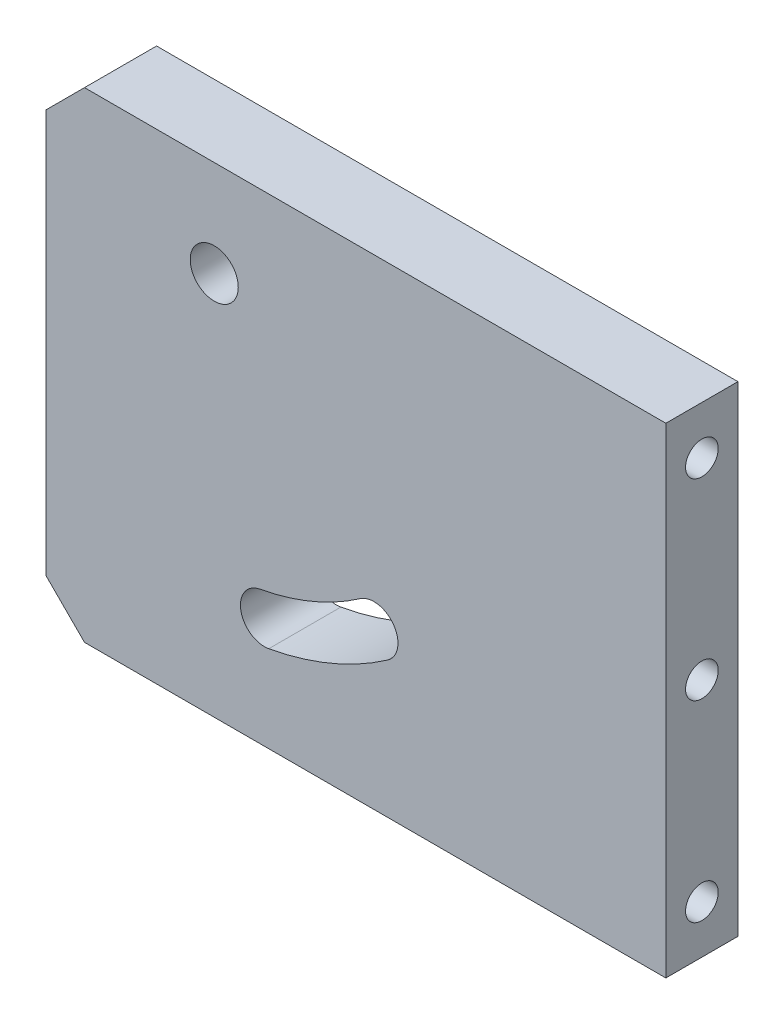
ISO-10303-21;
HEADER;
FILE_DESCRIPTION(('STEP AP214'),'2;1');
FILE_NAME('part.step','',(''),(''),'','','');
FILE_SCHEMA(('AUTOMOTIVE_DESIGN { 1 0 10303 214 1 1 1 1 }'));
ENDSEC;
DATA;
#1=APPLICATION_CONTEXT('core data for automotive mechanical design processes');
#2=APPLICATION_PROTOCOL_DEFINITION('international standard','automotive_design',2000,#1);
#3=PRODUCT_CONTEXT('',#1,'mechanical');
#4=PRODUCT('Part','Part','',(#3));
#5=PRODUCT_RELATED_PRODUCT_CATEGORY('part','',(#4));
#6=PRODUCT_DEFINITION_FORMATION('','',#4);
#7=PRODUCT_DEFINITION_CONTEXT('part definition',#1,'design');
#8=PRODUCT_DEFINITION('design','',#6,#7);
#9=PRODUCT_DEFINITION_SHAPE('','',#8);
#10=(LENGTH_UNIT() NAMED_UNIT(*) SI_UNIT(.MILLI.,.METRE.));
#11=(NAMED_UNIT(*) PLANE_ANGLE_UNIT() SI_UNIT($,.RADIAN.));
#12=(NAMED_UNIT(*) SI_UNIT($,.STERADIAN.) SOLID_ANGLE_UNIT());
#13=UNCERTAINTY_MEASURE_WITH_UNIT(LENGTH_MEASURE(1.E-05),#10,'distance_accuracy_value','');
#14=(GEOMETRIC_REPRESENTATION_CONTEXT(3) GLOBAL_UNCERTAINTY_ASSIGNED_CONTEXT((#13)) GLOBAL_UNIT_ASSIGNED_CONTEXT((#10,
#11,#12)) REPRESENTATION_CONTEXT('',''));
#15=CARTESIAN_POINT('',(0.,0.,0.));
#16=DIRECTION('',(0.,0.,1.));
#17=DIRECTION('',(1.,0.,0.));
#18=AXIS2_PLACEMENT_3D('',#15,#16,#17);
#19=CARTESIAN_POINT('',(64.5,-50.,15.));
#20=DIRECTION('',(-1.,0.,0.));
#21=DIRECTION('',(0.,0.,1.));
#22=AXIS2_PLACEMENT_3D('',#19,#20,#21);
#23=PLANE('',#22);
#24=CARTESIAN_POINT('',(64.5,40.,7.5));
#25=DIRECTION('',(1.,0.,0.));
#26=DIRECTION('',(0.,0.,-1.));
#27=AXIS2_PLACEMENT_3D('',#24,#25,#26);
#28=CIRCLE('',#27,3.4);
#29=CARTESIAN_POINT('',(64.5,40.,4.1));
#30=VERTEX_POINT('',#29);
#31=EDGE_CURVE('E132',#30,#30,#28,.T.);
#32=ORIENTED_EDGE('',*,*,#31,.F.);
#33=EDGE_LOOP('',(#32));
#34=FACE_BOUND('',#33,.T.);
#35=CARTESIAN_POINT('',(64.5,0.,7.5));
#36=DIRECTION('',(1.,0.,0.));
#37=DIRECTION('',(0.,0.,-1.));
#38=AXIS2_PLACEMENT_3D('',#35,#36,#37);
#39=CIRCLE('',#38,3.4);
#40=CARTESIAN_POINT('',(64.5,0.,4.1));
#41=VERTEX_POINT('',#40);
#42=EDGE_CURVE('E131',#41,#41,#39,.T.);
#43=ORIENTED_EDGE('',*,*,#42,.F.);
#44=EDGE_LOOP('',(#43));
#45=FACE_BOUND('',#44,.T.);
#46=DIRECTION('',(0.,1.,0.));
#47=VECTOR('',#46,1.);
#48=CARTESIAN_POINT('',(64.5,-50.,0.));
#49=LINE('',#48,#47);
#50=CARTESIAN_POINT('',(64.5,-50.,0.));
#51=VERTEX_POINT('',#50);
#52=CARTESIAN_POINT('',(64.5,50.,0.));
#53=VERTEX_POINT('',#52);
#54=EDGE_CURVE('E177',#51,#53,#49,.T.);
#55=ORIENTED_EDGE('',*,*,#54,.T.);
#56=DIRECTION('',(0.,0.,-1.));
#57=VECTOR('',#56,1.);
#58=CARTESIAN_POINT('',(64.5,50.,15.));
#59=LINE('',#58,#57);
#60=CARTESIAN_POINT('',(64.5,50.,15.));
#61=VERTEX_POINT('',#60);
#62=EDGE_CURVE('E11',#61,#53,#59,.T.);
#63=ORIENTED_EDGE('',*,*,#62,.F.);
#64=DIRECTION('',(0.,1.,0.));
#65=VECTOR('',#64,1.);
#66=CARTESIAN_POINT('',(64.5,-50.,15.));
#67=LINE('',#66,#65);
#68=CARTESIAN_POINT('',(64.5,-50.,15.));
#69=VERTEX_POINT('',#68);
#70=EDGE_CURVE('E180',#69,#61,#67,.T.);
#71=ORIENTED_EDGE('',*,*,#70,.F.);
#72=DIRECTION('',(0.,0.,-1.));
#73=VECTOR('',#72,1.);
#74=CARTESIAN_POINT('',(64.5,-50.,15.));
#75=LINE('',#74,#73);
#76=EDGE_CURVE('E194',#69,#51,#75,.T.);
#77=ORIENTED_EDGE('',*,*,#76,.T.);
#78=EDGE_LOOP('',(#55,#63,#71,#77));
#79=FACE_BOUND('',#78,.T.);
#80=CARTESIAN_POINT('',(64.5,-40.,7.5));
#81=DIRECTION('',(1.,0.,0.));
#82=DIRECTION('',(0.,0.,-1.));
#83=AXIS2_PLACEMENT_3D('',#80,#81,#82);
#84=CIRCLE('',#83,3.4);
#85=CARTESIAN_POINT('',(64.5,-40.,4.1));
#86=VERTEX_POINT('',#85);
#87=EDGE_CURVE('E142',#86,#86,#84,.T.);
#88=ORIENTED_EDGE('',*,*,#87,.F.);
#89=EDGE_LOOP('',(#88));
#90=FACE_BOUND('',#89,.T.);
#91=ADVANCED_FACE('F36',(#34,#45,#79,#90),#23,.F.);
#92=CARTESIAN_POINT('',(64.5,50.,15.));
#93=DIRECTION('',(0.,0.,1.));
#94=DIRECTION('',(1.,0.,0.));
#95=AXIS2_PLACEMENT_3D('',#92,#93,#94);
#96=PLANE('',#95);
#97=CARTESIAN_POINT('',(-29.5,30.,15.));
#98=DIRECTION('',(0.,0.,1.));
#99=DIRECTION('',(1.,0.,0.));
#100=AXIS2_PLACEMENT_3D('',#97,#98,#99);
#101=CIRCLE('',#100,5.);
#102=CARTESIAN_POINT('',(-24.5,30.,15.));
#103=VERTEX_POINT('',#102);
#104=EDGE_CURVE('E174',#103,#103,#101,.T.);
#105=ORIENTED_EDGE('',*,*,#104,.F.);
#106=EDGE_LOOP('',(#105));
#107=FACE_BOUND('',#106,.T.);
#108=ORIENTED_EDGE('',*,*,#70,.T.);
#109=DIRECTION('',(-1.,0.,0.));
#110=VECTOR('',#109,1.);
#111=CARTESIAN_POINT('',(64.5,50.,15.));
#112=LINE('',#111,#110);
#113=CARTESIAN_POINT('',(-56.5,50.,15.));
#114=VERTEX_POINT('',#113);
#115=EDGE_CURVE('E183',#61,#114,#112,.T.);
#116=ORIENTED_EDGE('',*,*,#115,.T.);
#117=DIRECTION('',(-0.707106781186548,-0.707106781186548,0.));
#118=VECTOR('',#117,1.);
#119=CARTESIAN_POINT('',(-64.5,42.,15.));
#120=LINE('',#119,#118);
#121=CARTESIAN_POINT('',(-64.5,42.,15.));
#122=VERTEX_POINT('',#121);
#123=EDGE_CURVE('E186',#114,#122,#120,.T.);
#124=ORIENTED_EDGE('',*,*,#123,.T.);
#125=DIRECTION('',(0.,-1.,0.));
#126=VECTOR('',#125,1.);
#127=CARTESIAN_POINT('',(-64.5,-42.,15.));
#128=LINE('',#127,#126);
#129=CARTESIAN_POINT('',(-64.5,-42.,15.));
#130=VERTEX_POINT('',#129);
#131=EDGE_CURVE('E188',#122,#130,#128,.T.);
#132=ORIENTED_EDGE('',*,*,#131,.T.);
#133=DIRECTION('',(0.707106781186548,-0.707106781186547,0.));
#134=VECTOR('',#133,1.);
#135=CARTESIAN_POINT('',(-64.5,-42.,15.));
#136=LINE('',#135,#134);
#137=CARTESIAN_POINT('',(-56.5,-50.,15.));
#138=VERTEX_POINT('',#137);
#139=EDGE_CURVE('E190',#130,#138,#136,.T.);
#140=ORIENTED_EDGE('',*,*,#139,.T.);
#141=DIRECTION('',(1.,0.,0.));
#142=VECTOR('',#141,1.);
#143=CARTESIAN_POINT('',(64.5,-50.,15.));
#144=LINE('',#143,#142);
#145=EDGE_CURVE('E192',#138,#69,#144,.T.);
#146=ORIENTED_EDGE('',*,*,#145,.T.);
#147=EDGE_LOOP('',(#108,#116,#124,#132,#140,#146));
#148=FACE_BOUND('',#147,.T.);
#149=CARTESIAN_POINT('',(-29.5,30.,15.));
#150=DIRECTION('',(0.,0.,1.));
#151=DIRECTION('',(1.,0.,0.));
#152=AXIS2_PLACEMENT_3D('',#149,#150,#151);
#153=CIRCLE('',#152,63.);
#154=CARTESIAN_POINT('',(-18.1489244079897,-31.9689687093828,15.));
#155=VERTEX_POINT('',#154);
#156=CARTESIAN_POINT('',(6.60828939653203,-21.6254921221705,15.));
#157=VERTEX_POINT('',#156);
#158=EDGE_CURVE('E150',#155,#157,#153,.T.);
#159=ORIENTED_EDGE('',*,*,#158,.F.);
#160=CARTESIAN_POINT('',(-19.0498034232286,-27.0507965895905,15.));
#161=DIRECTION('',(0.,0.,1.));
#162=DIRECTION('',(1.,0.,0.));
#163=AXIS2_PLACEMENT_3D('',#160,#161,#162);
#164=CIRCLE('',#163,5.00000000000001);
#165=CARTESIAN_POINT('',(-19.9506824384675,-22.1326244697982,15.));
#166=VERTEX_POINT('',#165);
#167=EDGE_CURVE('E148',#166,#155,#164,.T.);
#168=ORIENTED_EDGE('',*,*,#167,.F.);
#169=CARTESIAN_POINT('',(-29.5,30.,15.));
#170=DIRECTION('',(0.,0.,-1.));
#171=DIRECTION('',(1.,0.,0.));
#172=AXIS2_PLACEMENT_3D('',#169,#170,#171);
#173=CIRCLE('',#172,53.);
#174=CARTESIAN_POINT('',(0.876814889146,-13.4309695630958,15.));
#175=VERTEX_POINT('',#174);
#176=EDGE_CURVE('E155',#175,#166,#173,.T.);
#177=ORIENTED_EDGE('',*,*,#176,.F.);
#178=CARTESIAN_POINT('',(3.74255214283901,-17.5282308426332,15.));
#179=DIRECTION('',(0.,0.,1.));
#180=DIRECTION('',(1.,0.,0.));
#181=AXIS2_PLACEMENT_3D('',#178,#179,#180);
#182=CIRCLE('',#181,5.);
#183=EDGE_CURVE('E153',#157,#175,#182,.T.);
#184=ORIENTED_EDGE('',*,*,#183,.F.);
#185=EDGE_LOOP('',(#159,#168,#177,#184));
#186=FACE_BOUND('',#185,.T.);
#187=ADVANCED_FACE('F241',(#107,#148,#186),#96,.T.);
#188=CARTESIAN_POINT('',(64.5,50.,0.));
#189=DIRECTION('',(0.,0.,1.));
#190=DIRECTION('',(1.,0.,0.));
#191=AXIS2_PLACEMENT_3D('',#188,#189,#190);
#192=PLANE('',#191);
#193=CARTESIAN_POINT('',(-29.5,30.,0.));
#194=DIRECTION('',(0.,0.,1.));
#195=DIRECTION('',(1.,0.,0.));
#196=AXIS2_PLACEMENT_3D('',#193,#194,#195);
#197=CIRCLE('',#196,5.);
#198=CARTESIAN_POINT('',(-24.5,30.,0.));
#199=VERTEX_POINT('',#198);
#200=EDGE_CURVE('E173',#199,#199,#197,.T.);
#201=ORIENTED_EDGE('',*,*,#200,.T.);
#202=EDGE_LOOP('',(#201));
#203=FACE_BOUND('',#202,.T.);
#204=ORIENTED_EDGE('',*,*,#54,.F.);
#205=DIRECTION('',(1.,0.,0.));
#206=VECTOR('',#205,1.);
#207=CARTESIAN_POINT('',(64.5,-50.,0.));
#208=LINE('',#207,#206);
#209=CARTESIAN_POINT('',(-56.5,-50.,0.));
#210=VERTEX_POINT('',#209);
#211=EDGE_CURVE('E184',#210,#51,#208,.T.);
#212=ORIENTED_EDGE('',*,*,#211,.F.);
#213=DIRECTION('',(0.707106781186548,-0.707106781186547,0.));
#214=VECTOR('',#213,1.);
#215=CARTESIAN_POINT('',(-64.5,-42.,0.));
#216=LINE('',#215,#214);
#217=CARTESIAN_POINT('',(-64.5,-42.,0.));
#218=VERTEX_POINT('',#217);
#219=EDGE_CURVE('E203',#218,#210,#216,.T.);
#220=ORIENTED_EDGE('',*,*,#219,.F.);
#221=DIRECTION('',(0.,-1.,0.));
#222=VECTOR('',#221,1.);
#223=CARTESIAN_POINT('',(-64.5,-42.,0.));
#224=LINE('',#223,#222);
#225=CARTESIAN_POINT('',(-64.5,42.,0.));
#226=VERTEX_POINT('',#225);
#227=EDGE_CURVE('E201',#226,#218,#224,.T.);
#228=ORIENTED_EDGE('',*,*,#227,.F.);
#229=DIRECTION('',(-0.707106781186548,-0.707106781186548,0.));
#230=VECTOR('',#229,1.);
#231=CARTESIAN_POINT('',(-64.5,42.,0.));
#232=LINE('',#231,#230);
#233=CARTESIAN_POINT('',(-56.5,50.,0.));
#234=VERTEX_POINT('',#233);
#235=EDGE_CURVE('E199',#234,#226,#232,.T.);
#236=ORIENTED_EDGE('',*,*,#235,.F.);
#237=DIRECTION('',(-1.,0.,0.));
#238=VECTOR('',#237,1.);
#239=CARTESIAN_POINT('',(64.5,50.,0.));
#240=LINE('',#239,#238);
#241=EDGE_CURVE('E197',#53,#234,#240,.T.);
#242=ORIENTED_EDGE('',*,*,#241,.F.);
#243=EDGE_LOOP('',(#204,#212,#220,#228,#236,#242));
#244=FACE_BOUND('',#243,.T.);
#245=CARTESIAN_POINT('',(-19.0498034232286,-27.0507965895905,0.));
#246=DIRECTION('',(0.,0.,1.));
#247=DIRECTION('',(1.,0.,0.));
#248=AXIS2_PLACEMENT_3D('',#245,#246,#247);
#249=CIRCLE('',#248,5.00000000000001);
#250=CARTESIAN_POINT('',(-19.9506824384675,-22.1326244697982,0.));
#251=VERTEX_POINT('',#250);
#252=CARTESIAN_POINT('',(-18.1489244079897,-31.9689687093828,0.));
#253=VERTEX_POINT('',#252);
#254=EDGE_CURVE('E58',#251,#253,#249,.T.);
#255=ORIENTED_EDGE('',*,*,#254,.T.);
#256=CARTESIAN_POINT('',(-29.5,30.,0.));
#257=DIRECTION('',(0.,0.,1.));
#258=DIRECTION('',(1.,0.,0.));
#259=AXIS2_PLACEMENT_3D('',#256,#257,#258);
#260=CIRCLE('',#259,63.);
#261=CARTESIAN_POINT('',(6.60828939653203,-21.6254921221705,0.));
#262=VERTEX_POINT('',#261);
#263=EDGE_CURVE('E159',#253,#262,#260,.T.);
#264=ORIENTED_EDGE('',*,*,#263,.T.);
#265=CARTESIAN_POINT('',(3.74255214283901,-17.5282308426332,0.));
#266=DIRECTION('',(0.,0.,1.));
#267=DIRECTION('',(1.,0.,0.));
#268=AXIS2_PLACEMENT_3D('',#265,#266,#267);
#269=CIRCLE('',#268,5.);
#270=CARTESIAN_POINT('',(0.876814889145986,-13.4309695630958,0.));
#271=VERTEX_POINT('',#270);
#272=EDGE_CURVE('E162',#262,#271,#269,.T.);
#273=ORIENTED_EDGE('',*,*,#272,.T.);
#274=CARTESIAN_POINT('',(-29.5,30.,0.));
#275=DIRECTION('',(0.,0.,-1.));
#276=DIRECTION('',(1.,0.,0.));
#277=AXIS2_PLACEMENT_3D('',#274,#275,#276);
#278=CIRCLE('',#277,53.);
#279=EDGE_CURVE('E151',#271,#251,#278,.T.);
#280=ORIENTED_EDGE('',*,*,#279,.T.);
#281=EDGE_LOOP('',(#255,#264,#273,#280));
#282=FACE_BOUND('',#281,.T.);
#283=ADVANCED_FACE('F227',(#203,#244,#282),#192,.F.);
#284=CARTESIAN_POINT('',(64.5,50.,15.));
#285=DIRECTION('',(0.,-1.,0.));
#286=DIRECTION('',(1.,0.,0.));
#287=AXIS2_PLACEMENT_3D('',#284,#285,#286);
#288=PLANE('',#287);
#289=ORIENTED_EDGE('',*,*,#241,.T.);
#290=DIRECTION('',(0.,0.,-1.));
#291=VECTOR('',#290,1.);
#292=CARTESIAN_POINT('',(-56.5,50.,15.));
#293=LINE('',#292,#291);
#294=EDGE_CURVE('E43',#114,#234,#293,.T.);
#295=ORIENTED_EDGE('',*,*,#294,.F.);
#296=ORIENTED_EDGE('',*,*,#115,.F.);
#297=ORIENTED_EDGE('',*,*,#62,.T.);
#298=EDGE_LOOP('',(#289,#295,#296,#297));
#299=FACE_BOUND('',#298,.T.);
#300=ADVANCED_FACE('F246',(#299),#288,.F.);
#301=CARTESIAN_POINT('',(-64.5,42.,15.));
#302=DIRECTION('',(0.707106781186547,-0.707106781186547,0.));
#303=DIRECTION('',(0.707106781186548,0.707106781186548,0.));
#304=AXIS2_PLACEMENT_3D('',#301,#302,#303);
#305=PLANE('',#304);
#306=ORIENTED_EDGE('',*,*,#235,.T.);
#307=DIRECTION('',(0.,0.,-1.));
#308=VECTOR('',#307,1.);
#309=CARTESIAN_POINT('',(-64.5,42.,15.));
#310=LINE('',#309,#308);
#311=EDGE_CURVE('E214',#122,#226,#310,.T.);
#312=ORIENTED_EDGE('',*,*,#311,.F.);
#313=ORIENTED_EDGE('',*,*,#123,.F.);
#314=ORIENTED_EDGE('',*,*,#294,.T.);
#315=EDGE_LOOP('',(#306,#312,#313,#314));
#316=FACE_BOUND('',#315,.T.);
#317=ADVANCED_FACE('F221',(#316),#305,.F.);
#318=CARTESIAN_POINT('',(-64.5,-42.,15.));
#319=DIRECTION('',(1.,0.,0.));
#320=DIRECTION('',(0.,0.,-1.));
#321=AXIS2_PLACEMENT_3D('',#318,#319,#320);
#322=PLANE('',#321);
#323=ORIENTED_EDGE('',*,*,#227,.T.);
#324=DIRECTION('',(0.,0.,-1.));
#325=VECTOR('',#324,1.);
#326=CARTESIAN_POINT('',(-64.5,-42.,15.));
#327=LINE('',#326,#325);
#328=EDGE_CURVE('E211',#130,#218,#327,.T.);
#329=ORIENTED_EDGE('',*,*,#328,.F.);
#330=ORIENTED_EDGE('',*,*,#131,.F.);
#331=ORIENTED_EDGE('',*,*,#311,.T.);
#332=EDGE_LOOP('',(#323,#329,#330,#331));
#333=FACE_BOUND('',#332,.T.);
#334=ADVANCED_FACE('F233',(#333),#322,.F.);
#335=CARTESIAN_POINT('',(-64.5,-42.,15.));
#336=DIRECTION('',(0.707106781186547,0.707106781186548,0.));
#337=DIRECTION('',(-0.707106781186548,0.707106781186547,0.));
#338=AXIS2_PLACEMENT_3D('',#335,#336,#337);
#339=PLANE('',#338);
#340=ORIENTED_EDGE('',*,*,#219,.T.);
#341=DIRECTION('',(0.,0.,-1.));
#342=VECTOR('',#341,1.);
#343=CARTESIAN_POINT('',(-56.5,-50.,15.));
#344=LINE('',#343,#342);
#345=EDGE_CURVE('E208',#138,#210,#344,.T.);
#346=ORIENTED_EDGE('',*,*,#345,.F.);
#347=ORIENTED_EDGE('',*,*,#139,.F.);
#348=ORIENTED_EDGE('',*,*,#328,.T.);
#349=EDGE_LOOP('',(#340,#346,#347,#348));
#350=FACE_BOUND('',#349,.T.);
#351=ADVANCED_FACE('F237',(#350),#339,.F.);
#352=CARTESIAN_POINT('',(64.5,-50.,15.));
#353=DIRECTION('',(0.,1.,0.));
#354=DIRECTION('',(-1.,0.,0.));
#355=AXIS2_PLACEMENT_3D('',#352,#353,#354);
#356=PLANE('',#355);
#357=ORIENTED_EDGE('',*,*,#211,.T.);
#358=ORIENTED_EDGE('',*,*,#76,.F.);
#359=ORIENTED_EDGE('',*,*,#145,.F.);
#360=ORIENTED_EDGE('',*,*,#345,.T.);
#361=EDGE_LOOP('',(#357,#358,#359,#360));
#362=FACE_BOUND('',#361,.T.);
#363=ADVANCED_FACE('F250',(#362),#356,.F.);
#364=CARTESIAN_POINT('',(-29.5,30.,15.));
#365=DIRECTION('',(0.,0.,-1.));
#366=DIRECTION('',(-1.,0.,0.));
#367=AXIS2_PLACEMENT_3D('',#364,#365,#366);
#368=CYLINDRICAL_SURFACE('',#367,5.);
#369=ORIENTED_EDGE('',*,*,#104,.T.);
#370=EDGE_LOOP('',(#369));
#371=FACE_BOUND('',#370,.T.);
#372=ORIENTED_EDGE('',*,*,#200,.F.);
#373=EDGE_LOOP('',(#372));
#374=FACE_BOUND('',#373,.T.);
#375=ADVANCED_FACE('F252',(#371,#374),#368,.F.);
#376=CARTESIAN_POINT('',(-19.0498034232286,-27.0507965895905,15.));
#377=DIRECTION('',(0.,0.,-1.));
#378=DIRECTION('',(-1.,0.,0.));
#379=AXIS2_PLACEMENT_3D('',#376,#377,#378);
#380=CYLINDRICAL_SURFACE('',#379,5.00000000000001);
#381=ORIENTED_EDGE('',*,*,#254,.F.);
#382=DIRECTION('',(0.,0.,-1.));
#383=VECTOR('',#382,1.);
#384=CARTESIAN_POINT('',(-19.9506824384675,-22.1326244697982,15.));
#385=LINE('',#384,#383);
#386=EDGE_CURVE('E157',#166,#251,#385,.T.);
#387=ORIENTED_EDGE('',*,*,#386,.F.);
#388=ORIENTED_EDGE('',*,*,#167,.T.);
#389=DIRECTION('',(0.,0.,-1.));
#390=VECTOR('',#389,1.);
#391=CARTESIAN_POINT('',(-18.1489244079897,-31.9689687093828,15.));
#392=LINE('',#391,#390);
#393=EDGE_CURVE('E171',#155,#253,#392,.T.);
#394=ORIENTED_EDGE('',*,*,#393,.T.);
#395=EDGE_LOOP('',(#381,#387,#388,#394));
#396=FACE_BOUND('',#395,.T.);
#397=ADVANCED_FACE('F258',(#396),#380,.F.);
#398=CARTESIAN_POINT('',(-29.5,30.,15.));
#399=DIRECTION('',(0.,0.,-1.));
#400=DIRECTION('',(-1.,0.,0.));
#401=AXIS2_PLACEMENT_3D('',#398,#399,#400);
#402=CYLINDRICAL_SURFACE('',#401,63.);
#403=ORIENTED_EDGE('',*,*,#263,.F.);
#404=ORIENTED_EDGE('',*,*,#393,.F.);
#405=ORIENTED_EDGE('',*,*,#158,.T.);
#406=DIRECTION('',(0.,0.,-1.));
#407=VECTOR('',#406,1.);
#408=CARTESIAN_POINT('',(6.60828939653203,-21.6254921221705,15.));
#409=LINE('',#408,#407);
#410=EDGE_CURVE('E169',#157,#262,#409,.T.);
#411=ORIENTED_EDGE('',*,*,#410,.T.);
#412=EDGE_LOOP('',(#403,#404,#405,#411));
#413=FACE_BOUND('',#412,.T.);
#414=ADVANCED_FACE('F300',(#413),#402,.F.);
#415=CARTESIAN_POINT('',(3.74255214283901,-17.5282308426332,15.));
#416=DIRECTION('',(0.,0.,-1.));
#417=DIRECTION('',(-1.,0.,0.));
#418=AXIS2_PLACEMENT_3D('',#415,#416,#417);
#419=CYLINDRICAL_SURFACE('',#418,5.);
#420=ORIENTED_EDGE('',*,*,#272,.F.);
#421=ORIENTED_EDGE('',*,*,#410,.F.);
#422=ORIENTED_EDGE('',*,*,#183,.T.);
#423=DIRECTION('',(0.,0.,-1.));
#424=VECTOR('',#423,1.);
#425=CARTESIAN_POINT('',(0.876814889145986,-13.4309695630958,15.));
#426=LINE('',#425,#424);
#427=EDGE_CURVE('E50',#175,#271,#426,.T.);
#428=ORIENTED_EDGE('',*,*,#427,.T.);
#429=EDGE_LOOP('',(#420,#421,#422,#428));
#430=FACE_BOUND('',#429,.T.);
#431=ADVANCED_FACE('F297',(#430),#419,.F.);
#432=CARTESIAN_POINT('',(-29.5,30.,15.));
#433=DIRECTION('',(0.,0.,-1.));
#434=DIRECTION('',(-1.,0.,0.));
#435=AXIS2_PLACEMENT_3D('',#432,#433,#434);
#436=CYLINDRICAL_SURFACE('',#435,53.);
#437=ORIENTED_EDGE('',*,*,#279,.F.);
#438=ORIENTED_EDGE('',*,*,#427,.F.);
#439=ORIENTED_EDGE('',*,*,#176,.T.);
#440=ORIENTED_EDGE('',*,*,#386,.T.);
#441=EDGE_LOOP('',(#437,#438,#439,#440));
#442=FACE_BOUND('',#441,.T.);
#443=ADVANCED_FACE('F293',(#442),#436,.T.);
#444=CARTESIAN_POINT('',(44.5,-40.,7.5));
#445=DIRECTION('',(1.,0.,0.));
#446=DIRECTION('',(0.,0.,-1.));
#447=AXIS2_PLACEMENT_3D('',#444,#445,#446);
#448=CONICAL_SURFACE('',#447,3.39999999999999,1.02974425867665);
#449=CARTESIAN_POINT('',(42.4570738953063,-40.,7.5));
#450=VERTEX_POINT('',#449);
#451=VERTEX_LOOP('',#450);
#452=FACE_BOUND('',#451,.T.);
#453=CARTESIAN_POINT('',(44.5,-40.,7.5));
#454=DIRECTION('',(1.,0.,0.));
#455=DIRECTION('',(0.,0.,-1.));
#456=AXIS2_PLACEMENT_3D('',#453,#454,#455);
#457=CIRCLE('',#456,3.39999999999999);
#458=CARTESIAN_POINT('',(44.5,-40.,4.10000000000001));
#459=VERTEX_POINT('',#458);
#460=EDGE_CURVE('E145',#459,#459,#457,.T.);
#461=ORIENTED_EDGE('',*,*,#460,.T.);
#462=EDGE_LOOP('',(#461));
#463=FACE_BOUND('',#462,.T.);
#464=ADVANCED_FACE('F289',(#452,#463),#448,.F.);
#465=CARTESIAN_POINT('',(64.5,-40.,7.5));
#466=DIRECTION('',(1.,0.,0.));
#467=DIRECTION('',(0.,0.,-1.));
#468=AXIS2_PLACEMENT_3D('',#465,#466,#467);
#469=CYLINDRICAL_SURFACE('',#468,3.4);
#470=ORIENTED_EDGE('',*,*,#460,.F.);
#471=EDGE_LOOP('',(#470));
#472=FACE_BOUND('',#471,.T.);
#473=ORIENTED_EDGE('',*,*,#87,.T.);
#474=EDGE_LOOP('',(#473));
#475=FACE_BOUND('',#474,.T.);
#476=ADVANCED_FACE('F281',(#472,#475),#469,.F.);
#477=CARTESIAN_POINT('',(44.5,0.,7.5));
#478=DIRECTION('',(1.,0.,0.));
#479=DIRECTION('',(0.,0.,-1.));
#480=AXIS2_PLACEMENT_3D('',#477,#478,#479);
#481=CONICAL_SURFACE('',#480,3.4,1.02974425867665);
#482=CARTESIAN_POINT('',(42.4570738953063,0.,7.5));
#483=VERTEX_POINT('',#482);
#484=VERTEX_LOOP('',#483);
#485=FACE_BOUND('',#484,.T.);
#486=CARTESIAN_POINT('',(44.5,0.,7.5));
#487=DIRECTION('',(1.,0.,0.));
#488=DIRECTION('',(0.,0.,-1.));
#489=AXIS2_PLACEMENT_3D('',#486,#487,#488);
#490=CIRCLE('',#489,3.4);
#491=CARTESIAN_POINT('',(44.5,0.,4.1));
#492=VERTEX_POINT('',#491);
#493=EDGE_CURVE('E135',#492,#492,#490,.T.);
#494=ORIENTED_EDGE('',*,*,#493,.T.);
#495=EDGE_LOOP('',(#494));
#496=FACE_BOUND('',#495,.T.);
#497=ADVANCED_FACE('F275',(#485,#496),#481,.F.);
#498=CARTESIAN_POINT('',(64.5,0.,7.5));
#499=DIRECTION('',(1.,0.,0.));
#500=DIRECTION('',(0.,0.,-1.));
#501=AXIS2_PLACEMENT_3D('',#498,#499,#500);
#502=CYLINDRICAL_SURFACE('',#501,3.4);
#503=ORIENTED_EDGE('',*,*,#493,.F.);
#504=EDGE_LOOP('',(#503));
#505=FACE_BOUND('',#504,.T.);
#506=ORIENTED_EDGE('',*,*,#42,.T.);
#507=EDGE_LOOP('',(#506));
#508=FACE_BOUND('',#507,.T.);
#509=ADVANCED_FACE('F125',(#505,#508),#502,.F.);
#510=CARTESIAN_POINT('',(44.5,40.,7.5));
#511=DIRECTION('',(1.,0.,0.));
#512=DIRECTION('',(0.,0.,-1.));
#513=AXIS2_PLACEMENT_3D('',#510,#511,#512);
#514=CONICAL_SURFACE('',#513,3.39999999999999,1.02974425867665);
#515=CARTESIAN_POINT('',(42.4570738953063,40.,7.5));
#516=VERTEX_POINT('',#515);
#517=VERTEX_LOOP('',#516);
#518=FACE_BOUND('',#517,.T.);
#519=CARTESIAN_POINT('',(44.5,40.,7.5));
#520=DIRECTION('',(1.,0.,0.));
#521=DIRECTION('',(0.,0.,-1.));
#522=AXIS2_PLACEMENT_3D('',#519,#520,#521);
#523=CIRCLE('',#522,3.39999999999999);
#524=CARTESIAN_POINT('',(44.5,40.,4.10000000000001));
#525=VERTEX_POINT('',#524);
#526=EDGE_CURVE('E129',#525,#525,#523,.T.);
#527=ORIENTED_EDGE('',*,*,#526,.T.);
#528=EDGE_LOOP('',(#527));
#529=FACE_BOUND('',#528,.T.);
#530=ADVANCED_FACE('F121',(#518,#529),#514,.F.);
#531=CARTESIAN_POINT('',(64.5,40.,7.5));
#532=DIRECTION('',(1.,0.,0.));
#533=DIRECTION('',(0.,0.,-1.));
#534=AXIS2_PLACEMENT_3D('',#531,#532,#533);
#535=CYLINDRICAL_SURFACE('',#534,3.4);
#536=ORIENTED_EDGE('',*,*,#526,.F.);
#537=EDGE_LOOP('',(#536));
#538=FACE_BOUND('',#537,.T.);
#539=ORIENTED_EDGE('',*,*,#31,.T.);
#540=EDGE_LOOP('',(#539));
#541=FACE_BOUND('',#540,.T.);
#542=ADVANCED_FACE('F124',(#538,#541),#535,.F.);
#543=CLOSED_SHELL('',(#91,#187,#283,#300,#317,#334,#351,#363,#375,#397,#414,#431,#443,#464,#476,
#497,#509,#530,#542));
#544=MANIFOLD_SOLID_BREP('B2',#543);
#545=ADVANCED_BREP_SHAPE_REPRESENTATION('',(#18,#544),#14);
#546=SHAPE_DEFINITION_REPRESENTATION(#9,#545);
ENDSEC;
END-ISO-10303-21;
